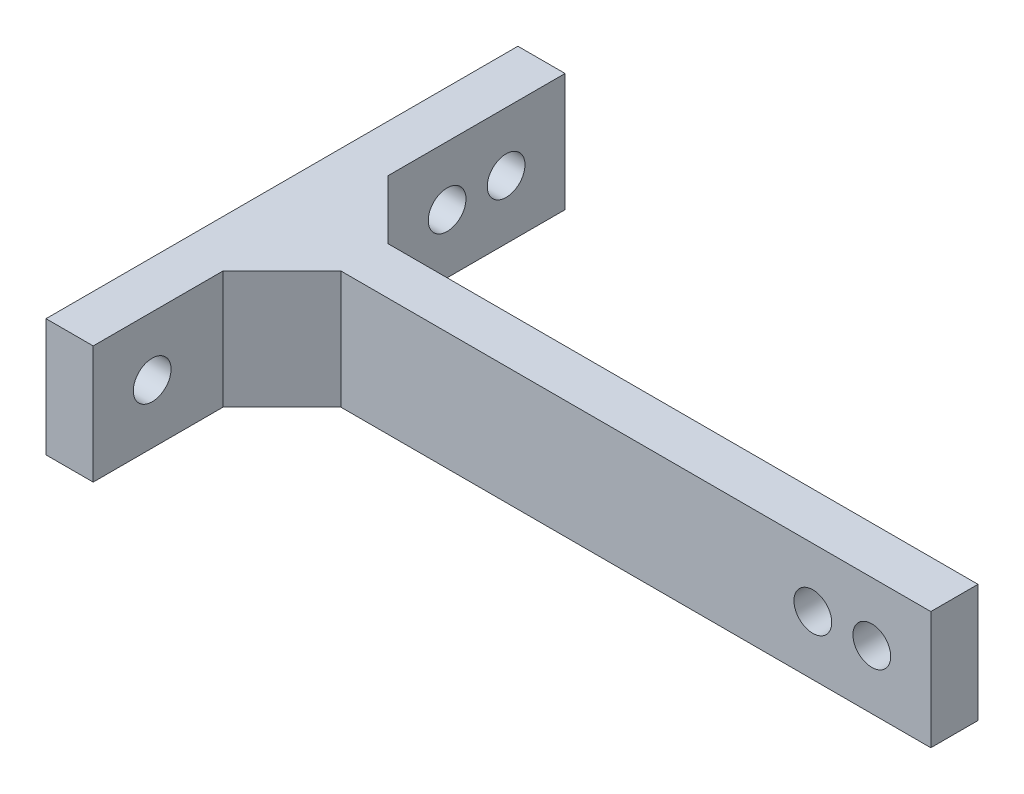
ISO-10303-21;
HEADER;
FILE_DESCRIPTION(('STEP AP214'),'2;1');
FILE_NAME('part.step','',(''),(''),'','','');
FILE_SCHEMA(('AUTOMOTIVE_DESIGN { 1 0 10303 214 1 1 1 1 }'));
ENDSEC;
DATA;
#1=APPLICATION_CONTEXT('core data for automotive mechanical design processes');
#2=APPLICATION_PROTOCOL_DEFINITION('international standard','automotive_design',2000,#1);
#3=PRODUCT_CONTEXT('',#1,'mechanical');
#4=PRODUCT('Part','Part','',(#3));
#5=PRODUCT_RELATED_PRODUCT_CATEGORY('part','',(#4));
#6=PRODUCT_DEFINITION_FORMATION('','',#4);
#7=PRODUCT_DEFINITION_CONTEXT('part definition',#1,'design');
#8=PRODUCT_DEFINITION('design','',#6,#7);
#9=PRODUCT_DEFINITION_SHAPE('','',#8);
#10=(LENGTH_UNIT() NAMED_UNIT(*) SI_UNIT(.MILLI.,.METRE.));
#11=(NAMED_UNIT(*) PLANE_ANGLE_UNIT() SI_UNIT($,.RADIAN.));
#12=(NAMED_UNIT(*) SI_UNIT($,.STERADIAN.) SOLID_ANGLE_UNIT());
#13=UNCERTAINTY_MEASURE_WITH_UNIT(LENGTH_MEASURE(1.E-05),#10,'distance_accuracy_value','');
#14=(GEOMETRIC_REPRESENTATION_CONTEXT(3) GLOBAL_UNCERTAINTY_ASSIGNED_CONTEXT((#13)) GLOBAL_UNIT_ASSIGNED_CONTEXT((#10,
#11,#12)) REPRESENTATION_CONTEXT('',''));
#15=CARTESIAN_POINT('',(0.,0.,0.));
#16=DIRECTION('',(0.,0.,1.));
#17=DIRECTION('',(1.,0.,0.));
#18=AXIS2_PLACEMENT_3D('',#15,#16,#17);
#19=CARTESIAN_POINT('',(0.,0.,4.));
#20=DIRECTION('',(0.,0.,1.));
#21=DIRECTION('',(1.,0.,0.));
#22=AXIS2_PLACEMENT_3D('',#19,#20,#21);
#23=PLANE('',#22);
#24=CARTESIAN_POINT('',(26.9796861870087,-2.54060324825986,4.));
#25=DIRECTION('',(0.,0.,1.));
#26=DIRECTION('',(1.,0.,0.));
#27=AXIS2_PLACEMENT_3D('',#24,#25,#26);
#28=CIRCLE('',#27,1.6);
#29=CARTESIAN_POINT('',(28.5796861870087,-2.54060324825986,4.));
#30=VERTEX_POINT('',#29);
#31=EDGE_CURVE('E147',#30,#30,#28,.T.);
#32=ORIENTED_EDGE('',*,*,#31,.F.);
#33=EDGE_LOOP('',(#32));
#34=FACE_BOUND('',#33,.T.);
#35=CARTESIAN_POINT('',(21.9796861870087,-2.54060324825989,4.));
#36=DIRECTION('',(0.,0.,1.));
#37=DIRECTION('',(1.,0.,0.));
#38=AXIS2_PLACEMENT_3D('',#35,#36,#37);
#39=CIRCLE('',#38,1.6);
#40=CARTESIAN_POINT('',(23.5796861870087,-2.54060324825989,4.));
#41=VERTEX_POINT('',#40);
#42=EDGE_CURVE('E152',#41,#41,#39,.T.);
#43=ORIENTED_EDGE('',*,*,#42,.F.);
#44=EDGE_LOOP('',(#43));
#45=FACE_BOUND('',#44,.T.);
#46=DIRECTION('',(-1.,0.,0.));
#47=VECTOR('',#46,1.);
#48=CARTESIAN_POINT('',(-23.0203138129913,2.45939675174014,4.));
#49=LINE('',#48,#47);
#50=CARTESIAN_POINT('',(31.9796861870087,2.45939675174014,4.));
#51=VERTEX_POINT('',#50);
#52=CARTESIAN_POINT('',(-18.0203138129913,2.45939675174014,4.));
#53=VERTEX_POINT('',#52);
#54=EDGE_CURVE('E118',#51,#53,#49,.T.);
#55=ORIENTED_EDGE('',*,*,#54,.T.);
#56=DIRECTION('',(0.,-1.,0.));
#57=VECTOR('',#56,1.);
#58=CARTESIAN_POINT('',(-18.0203138129913,2.45939675174014,4.));
#59=LINE('',#58,#57);
#60=CARTESIAN_POINT('',(-18.0203138129913,-7.54060324825986,4.));
#61=VERTEX_POINT('',#60);
#62=EDGE_CURVE('E123',#53,#61,#59,.T.);
#63=ORIENTED_EDGE('',*,*,#62,.T.);
#64=DIRECTION('',(1.,0.,0.));
#65=VECTOR('',#64,1.);
#66=CARTESIAN_POINT('',(-23.0203138129913,-7.54060324825986,4.));
#67=LINE('',#66,#65);
#68=CARTESIAN_POINT('',(31.9796861870087,-7.54060324825986,4.));
#69=VERTEX_POINT('',#68);
#70=EDGE_CURVE('E135',#61,#69,#67,.T.);
#71=ORIENTED_EDGE('',*,*,#70,.T.);
#72=DIRECTION('',(0.,1.,0.));
#73=VECTOR('',#72,1.);
#74=CARTESIAN_POINT('',(31.9796861870087,2.45939675174014,4.));
#75=LINE('',#74,#73);
#76=EDGE_CURVE('E131',#69,#51,#75,.T.);
#77=ORIENTED_EDGE('',*,*,#76,.T.);
#78=EDGE_LOOP('',(#55,#63,#71,#77));
#79=FACE_BOUND('',#78,.T.);
#80=ADVANCED_FACE('F34',(#34,#45,#79),#23,.T.);
#81=CARTESIAN_POINT('',(-23.0203138129913,0.,0.));
#82=DIRECTION('',(-1.,0.,0.));
#83=DIRECTION('',(0.,0.,1.));
#84=AXIS2_PLACEMENT_3D('',#81,#82,#83);
#85=PLANE('',#84);
#86=CARTESIAN_POINT('',(-23.0203138129913,-2.54060324825986,15.));
#87=DIRECTION('',(1.,0.,0.));
#88=DIRECTION('',(0.,0.,-1.));
#89=AXIS2_PLACEMENT_3D('',#86,#87,#88);
#90=CIRCLE('',#89,1.6);
#91=CARTESIAN_POINT('',(-23.0203138129913,-2.54060324825986,13.4));
#92=VERTEX_POINT('',#91);
#93=EDGE_CURVE('E270',#92,#92,#90,.T.);
#94=ORIENTED_EDGE('',*,*,#93,.F.);
#95=EDGE_LOOP('',(#94));
#96=FACE_BOUND('',#95,.T.);
#97=DIRECTION('',(0.,-1.,0.));
#98=VECTOR('',#97,1.);
#99=CARTESIAN_POINT('',(-23.0203138129913,2.45939675174014,9.));
#100=LINE('',#99,#98);
#101=CARTESIAN_POINT('',(-23.0203138129913,2.45939675174014,9.));
#102=VERTEX_POINT('',#101);
#103=CARTESIAN_POINT('',(-23.0203138129913,-7.54060324825986,9.));
#104=VERTEX_POINT('',#103);
#105=EDGE_CURVE('E128',#102,#104,#100,.T.);
#106=ORIENTED_EDGE('',*,*,#105,.F.);
#107=DIRECTION('',(0.,0.,1.));
#108=VECTOR('',#107,1.);
#109=CARTESIAN_POINT('',(-23.0203138129913,2.45939675174014,-20.));
#110=LINE('',#109,#108);
#111=CARTESIAN_POINT('',(-23.0203138129913,2.45939675174014,20.));
#112=VERTEX_POINT('',#111);
#113=EDGE_CURVE('E120',#102,#112,#110,.T.);
#114=ORIENTED_EDGE('',*,*,#113,.T.);
#115=DIRECTION('',(0.,-1.,0.));
#116=VECTOR('',#115,1.);
#117=CARTESIAN_POINT('',(-23.0203138129913,2.45939675174014,20.));
#118=LINE('',#117,#116);
#119=CARTESIAN_POINT('',(-23.0203138129913,-7.54060324825986,20.));
#120=VERTEX_POINT('',#119);
#121=EDGE_CURVE('E195',#112,#120,#118,.T.);
#122=ORIENTED_EDGE('',*,*,#121,.T.);
#123=DIRECTION('',(0.,0.,1.));
#124=VECTOR('',#123,1.);
#125=CARTESIAN_POINT('',(-23.0203138129913,-7.54060324825986,-20.));
#126=LINE('',#125,#124);
#127=EDGE_CURVE('E191',#104,#120,#126,.T.);
#128=ORIENTED_EDGE('',*,*,#127,.F.);
#129=EDGE_LOOP('',(#106,#114,#122,#128));
#130=FACE_BOUND('',#129,.T.);
#131=ADVANCED_FACE('F234',(#96,#130),#85,.F.);
#132=CARTESIAN_POINT('',(0.,0.,0.));
#133=DIRECTION('',(0.,0.,1.));
#134=DIRECTION('',(1.,0.,0.));
#135=AXIS2_PLACEMENT_3D('',#132,#133,#134);
#136=PLANE('',#135);
#137=CARTESIAN_POINT('',(26.9796861870087,-2.54060324825986,0.));
#138=DIRECTION('',(0.,0.,1.));
#139=DIRECTION('',(1.,0.,0.));
#140=AXIS2_PLACEMENT_3D('',#137,#138,#139);
#141=CIRCLE('',#140,1.6);
#142=CARTESIAN_POINT('',(28.5796861870087,-2.54060324825986,0.));
#143=VERTEX_POINT('',#142);
#144=EDGE_CURVE('E38',#143,#143,#141,.T.);
#145=ORIENTED_EDGE('',*,*,#144,.T.);
#146=EDGE_LOOP('',(#145));
#147=FACE_BOUND('',#146,.T.);
#148=CARTESIAN_POINT('',(21.9796861870087,-2.54060324825989,0.));
#149=DIRECTION('',(0.,0.,1.));
#150=DIRECTION('',(1.,0.,0.));
#151=AXIS2_PLACEMENT_3D('',#148,#149,#150);
#152=CIRCLE('',#151,1.6);
#153=CARTESIAN_POINT('',(23.5796861870087,-2.54060324825989,0.));
#154=VERTEX_POINT('',#153);
#155=EDGE_CURVE('E145',#154,#154,#152,.T.);
#156=ORIENTED_EDGE('',*,*,#155,.T.);
#157=EDGE_LOOP('',(#156));
#158=FACE_BOUND('',#157,.T.);
#159=DIRECTION('',(0.,1.,0.));
#160=VECTOR('',#159,1.);
#161=CARTESIAN_POINT('',(-18.0203138129913,-7.54060324825986,0.));
#162=LINE('',#161,#160);
#163=CARTESIAN_POINT('',(-18.0203138129913,-7.54060324825986,0.));
#164=VERTEX_POINT('',#163);
#165=CARTESIAN_POINT('',(-18.0203138129913,2.45939675174014,0.));
#166=VERTEX_POINT('',#165);
#167=EDGE_CURVE('E168',#164,#166,#162,.T.);
#168=ORIENTED_EDGE('',*,*,#167,.T.);
#169=DIRECTION('',(-1.,0.,0.));
#170=VECTOR('',#169,1.);
#171=CARTESIAN_POINT('',(-23.0203138129913,2.45939675174014,0.));
#172=LINE('',#171,#170);
#173=CARTESIAN_POINT('',(31.9796861870087,2.45939675174014,0.));
#174=VERTEX_POINT('',#173);
#175=EDGE_CURVE('E143',#174,#166,#172,.T.);
#176=ORIENTED_EDGE('',*,*,#175,.F.);
#177=DIRECTION('',(0.,1.,0.));
#178=VECTOR('',#177,1.);
#179=CARTESIAN_POINT('',(31.9796861870087,2.45939675174014,0.));
#180=LINE('',#179,#178);
#181=CARTESIAN_POINT('',(31.9796861870087,-7.54060324825986,0.));
#182=VERTEX_POINT('',#181);
#183=EDGE_CURVE('E140',#182,#174,#180,.T.);
#184=ORIENTED_EDGE('',*,*,#183,.F.);
#185=DIRECTION('',(1.,0.,0.));
#186=VECTOR('',#185,1.);
#187=CARTESIAN_POINT('',(-23.0203138129913,-7.54060324825986,0.));
#188=LINE('',#187,#186);
#189=EDGE_CURVE('E59',#164,#182,#188,.T.);
#190=ORIENTED_EDGE('',*,*,#189,.F.);
#191=EDGE_LOOP('',(#168,#176,#184,#190));
#192=FACE_BOUND('',#191,.T.);
#193=ADVANCED_FACE('F211',(#147,#158,#192),#136,.F.);
#194=CARTESIAN_POINT('',(-23.0203138129913,-2.54060324825986,-10.));
#195=DIRECTION('',(1.,0.,0.));
#196=DIRECTION('',(0.,0.,-1.));
#197=AXIS2_PLACEMENT_3D('',#194,#195,#196);
#198=CIRCLE('',#197,1.6);
#199=CARTESIAN_POINT('',(-23.0203138129913,-2.54060324825986,-11.6));
#200=VERTEX_POINT('',#199);
#201=EDGE_CURVE('E257',#200,#200,#198,.T.);
#202=ORIENTED_EDGE('',*,*,#201,.F.);
#203=EDGE_LOOP('',(#202));
#204=FACE_BOUND('',#203,.T.);
#205=CARTESIAN_POINT('',(-23.0203138129913,-2.54060324825986,-15.));
#206=DIRECTION('',(1.,0.,0.));
#207=DIRECTION('',(0.,0.,-1.));
#208=AXIS2_PLACEMENT_3D('',#205,#206,#207);
#209=CIRCLE('',#208,1.6);
#210=CARTESIAN_POINT('',(-23.0203138129913,-2.54060324825986,-16.6));
#211=VERTEX_POINT('',#210);
#212=EDGE_CURVE('E160',#211,#211,#209,.T.);
#213=ORIENTED_EDGE('',*,*,#212,.F.);
#214=EDGE_LOOP('',(#213));
#215=FACE_BOUND('',#214,.T.);
#216=DIRECTION('',(0.,1.,0.));
#217=VECTOR('',#216,1.);
#218=CARTESIAN_POINT('',(-23.0203138129913,-7.54060324825986,-5.));
#219=LINE('',#218,#217);
#220=CARTESIAN_POINT('',(-23.0203138129913,-7.54060324825986,-5.));
#221=VERTEX_POINT('',#220);
#222=CARTESIAN_POINT('',(-23.0203138129913,2.45939675174014,-5.));
#223=VERTEX_POINT('',#222);
#224=EDGE_CURVE('E172',#221,#223,#219,.T.);
#225=ORIENTED_EDGE('',*,*,#224,.F.);
#226=CARTESIAN_POINT('',(-23.0203138129913,-7.54060324825986,-20.));
#227=VERTEX_POINT('',#226);
#228=EDGE_CURVE('E192',#227,#221,#126,.T.);
#229=ORIENTED_EDGE('',*,*,#228,.F.);
#230=DIRECTION('',(0.,-1.,0.));
#231=VECTOR('',#230,1.);
#232=CARTESIAN_POINT('',(-23.0203138129913,2.45939675174014,-20.));
#233=LINE('',#232,#231);
#234=CARTESIAN_POINT('',(-23.0203138129913,2.45939675174014,-20.));
#235=VERTEX_POINT('',#234);
#236=EDGE_CURVE('E175',#235,#227,#233,.T.);
#237=ORIENTED_EDGE('',*,*,#236,.F.);
#238=EDGE_CURVE('E180',#235,#223,#110,.T.);
#239=ORIENTED_EDGE('',*,*,#238,.T.);
#240=EDGE_LOOP('',(#225,#229,#237,#239));
#241=FACE_BOUND('',#240,.T.);
#242=ADVANCED_FACE('F220',(#204,#215,#241),#85,.F.);
#243=CARTESIAN_POINT('',(-23.0203138129913,-7.54060324825986,4.));
#244=DIRECTION('',(0.,1.,0.));
#245=DIRECTION('',(0.,0.,1.));
#246=AXIS2_PLACEMENT_3D('',#243,#244,#245);
#247=PLANE('',#246);
#248=ORIENTED_EDGE('',*,*,#70,.F.);
#249=DIRECTION('',(0.707106781186548,0.,-0.707106781186548));
#250=VECTOR('',#249,1.);
#251=CARTESIAN_POINT('',(-23.0203138129913,-7.54060324825986,9.));
#252=LINE('',#251,#250);
#253=EDGE_CURVE('E51',#104,#61,#252,.T.);
#254=ORIENTED_EDGE('',*,*,#253,.F.);
#255=ORIENTED_EDGE('',*,*,#127,.T.);
#256=DIRECTION('',(1.,0.,0.));
#257=VECTOR('',#256,1.);
#258=CARTESIAN_POINT('',(-27.0203138129913,-7.54060324825986,20.));
#259=LINE('',#258,#257);
#260=CARTESIAN_POINT('',(-27.0203138129913,-7.54060324825986,20.));
#261=VERTEX_POINT('',#260);
#262=EDGE_CURVE('E202',#261,#120,#259,.T.);
#263=ORIENTED_EDGE('',*,*,#262,.F.);
#264=DIRECTION('',(0.,0.,1.));
#265=VECTOR('',#264,1.);
#266=CARTESIAN_POINT('',(-27.0203138129913,-7.54060324825986,-20.));
#267=LINE('',#266,#265);
#268=CARTESIAN_POINT('',(-27.0203138129913,-7.54060324825986,-20.));
#269=VERTEX_POINT('',#268);
#270=EDGE_CURVE('E179',#269,#261,#267,.T.);
#271=ORIENTED_EDGE('',*,*,#270,.F.);
#272=DIRECTION('',(1.,0.,0.));
#273=VECTOR('',#272,1.);
#274=CARTESIAN_POINT('',(-27.0203138129913,-7.54060324825986,-20.));
#275=LINE('',#274,#273);
#276=EDGE_CURVE('E141',#269,#227,#275,.T.);
#277=ORIENTED_EDGE('',*,*,#276,.T.);
#278=ORIENTED_EDGE('',*,*,#228,.T.);
#279=DIRECTION('',(0.707106781186548,0.,0.707106781186547));
#280=VECTOR('',#279,1.);
#281=CARTESIAN_POINT('',(-23.0203138129913,-7.54060324825986,-5.));
#282=LINE('',#281,#280);
#283=EDGE_CURVE('E166',#221,#164,#282,.T.);
#284=ORIENTED_EDGE('',*,*,#283,.T.);
#285=ORIENTED_EDGE('',*,*,#189,.T.);
#286=DIRECTION('',(0.,0.,-1.));
#287=VECTOR('',#286,1.);
#288=CARTESIAN_POINT('',(31.9796861870087,-7.54060324825986,4.));
#289=LINE('',#288,#287);
#290=EDGE_CURVE('E11',#69,#182,#289,.T.);
#291=ORIENTED_EDGE('',*,*,#290,.F.);
#292=EDGE_LOOP('',(#248,#254,#255,#263,#271,#277,#278,#284,#285,#291));
#293=FACE_BOUND('',#292,.T.);
#294=ADVANCED_FACE('F36',(#293),#247,.F.);
#295=CARTESIAN_POINT('',(31.9796861870087,2.45939675174014,4.));
#296=DIRECTION('',(-1.,0.,0.));
#297=DIRECTION('',(0.,-1.,0.));
#298=AXIS2_PLACEMENT_3D('',#295,#296,#297);
#299=PLANE('',#298);
#300=ORIENTED_EDGE('',*,*,#183,.T.);
#301=DIRECTION('',(0.,0.,-1.));
#302=VECTOR('',#301,1.);
#303=CARTESIAN_POINT('',(31.9796861870087,2.45939675174014,4.));
#304=LINE('',#303,#302);
#305=EDGE_CURVE('E43',#51,#174,#304,.T.);
#306=ORIENTED_EDGE('',*,*,#305,.F.);
#307=ORIENTED_EDGE('',*,*,#76,.F.);
#308=ORIENTED_EDGE('',*,*,#290,.T.);
#309=EDGE_LOOP('',(#300,#306,#307,#308));
#310=FACE_BOUND('',#309,.T.);
#311=ADVANCED_FACE('F208',(#310),#299,.F.);
#312=CARTESIAN_POINT('',(-23.0203138129913,2.45939675174014,4.));
#313=DIRECTION('',(0.,-1.,0.));
#314=DIRECTION('',(1.,0.,0.));
#315=AXIS2_PLACEMENT_3D('',#312,#313,#314);
#316=PLANE('',#315);
#317=DIRECTION('',(0.707106781186548,0.,-0.707106781186548));
#318=VECTOR('',#317,1.);
#319=CARTESIAN_POINT('',(-23.0203138129913,2.45939675174014,9.));
#320=LINE('',#319,#318);
#321=EDGE_CURVE('E113',#102,#53,#320,.T.);
#322=ORIENTED_EDGE('',*,*,#321,.T.);
#323=ORIENTED_EDGE('',*,*,#54,.F.);
#324=ORIENTED_EDGE('',*,*,#305,.T.);
#325=ORIENTED_EDGE('',*,*,#175,.T.);
#326=DIRECTION('',(0.707106781186548,0.,0.707106781186547));
#327=VECTOR('',#326,1.);
#328=CARTESIAN_POINT('',(-23.0203138129913,2.45939675174014,-5.));
#329=LINE('',#328,#327);
#330=EDGE_CURVE('E164',#223,#166,#329,.T.);
#331=ORIENTED_EDGE('',*,*,#330,.F.);
#332=ORIENTED_EDGE('',*,*,#238,.F.);
#333=DIRECTION('',(1.,0.,0.));
#334=VECTOR('',#333,1.);
#335=CARTESIAN_POINT('',(-27.0203138129913,2.45939675174014,-20.));
#336=LINE('',#335,#334);
#337=CARTESIAN_POINT('',(-27.0203138129913,2.45939675174014,-20.));
#338=VERTEX_POINT('',#337);
#339=EDGE_CURVE('E188',#338,#235,#336,.T.);
#340=ORIENTED_EDGE('',*,*,#339,.F.);
#341=DIRECTION('',(0.,0.,1.));
#342=VECTOR('',#341,1.);
#343=CARTESIAN_POINT('',(-27.0203138129913,2.45939675174014,-20.));
#344=LINE('',#343,#342);
#345=CARTESIAN_POINT('',(-27.0203138129913,2.45939675174014,20.));
#346=VERTEX_POINT('',#345);
#347=EDGE_CURVE('E185',#338,#346,#344,.T.);
#348=ORIENTED_EDGE('',*,*,#347,.T.);
#349=DIRECTION('',(1.,0.,0.));
#350=VECTOR('',#349,1.);
#351=CARTESIAN_POINT('',(-27.0203138129913,2.45939675174014,20.));
#352=LINE('',#351,#350);
#353=EDGE_CURVE('E200',#346,#112,#352,.T.);
#354=ORIENTED_EDGE('',*,*,#353,.T.);
#355=ORIENTED_EDGE('',*,*,#113,.F.);
#356=EDGE_LOOP('',(#322,#323,#324,#325,#331,#332,#340,#348,#354,#355));
#357=FACE_BOUND('',#356,.T.);
#358=ADVANCED_FACE('F115',(#357),#316,.F.);
#359=CARTESIAN_POINT('',(-27.0203138129913,2.45939675174014,-20.));
#360=DIRECTION('',(0.,0.,1.));
#361=DIRECTION('',(0.,-1.,0.));
#362=AXIS2_PLACEMENT_3D('',#359,#360,#361);
#363=PLANE('',#362);
#364=ORIENTED_EDGE('',*,*,#236,.T.);
#365=ORIENTED_EDGE('',*,*,#276,.F.);
#366=DIRECTION('',(0.,-1.,0.));
#367=VECTOR('',#366,1.);
#368=CARTESIAN_POINT('',(-27.0203138129913,2.45939675174014,-20.));
#369=LINE('',#368,#367);
#370=EDGE_CURVE('E176',#338,#269,#369,.T.);
#371=ORIENTED_EDGE('',*,*,#370,.F.);
#372=ORIENTED_EDGE('',*,*,#339,.T.);
#373=EDGE_LOOP('',(#364,#365,#371,#372));
#374=FACE_BOUND('',#373,.T.);
#375=ADVANCED_FACE('F223',(#374),#363,.F.);
#376=CARTESIAN_POINT('',(-27.0203138129913,2.45939675174014,20.));
#377=DIRECTION('',(0.,0.,1.));
#378=DIRECTION('',(1.,0.,0.));
#379=AXIS2_PLACEMENT_3D('',#376,#377,#378);
#380=PLANE('',#379);
#381=ORIENTED_EDGE('',*,*,#121,.F.);
#382=ORIENTED_EDGE('',*,*,#353,.F.);
#383=DIRECTION('',(0.,-1.,0.));
#384=VECTOR('',#383,1.);
#385=CARTESIAN_POINT('',(-27.0203138129913,2.45939675174014,20.));
#386=LINE('',#385,#384);
#387=EDGE_CURVE('E182',#346,#261,#386,.T.);
#388=ORIENTED_EDGE('',*,*,#387,.T.);
#389=ORIENTED_EDGE('',*,*,#262,.T.);
#390=EDGE_LOOP('',(#381,#382,#388,#389));
#391=FACE_BOUND('',#390,.T.);
#392=ADVANCED_FACE('F230',(#391),#380,.T.);
#393=CARTESIAN_POINT('',(-27.0203138129913,0.,0.));
#394=DIRECTION('',(-1.,0.,0.));
#395=DIRECTION('',(0.,0.,1.));
#396=AXIS2_PLACEMENT_3D('',#393,#394,#395);
#397=PLANE('',#396);
#398=CARTESIAN_POINT('',(-27.0203138129913,-2.54060324825986,15.));
#399=DIRECTION('',(1.,0.,0.));
#400=DIRECTION('',(0.,0.,-1.));
#401=AXIS2_PLACEMENT_3D('',#398,#399,#400);
#402=CIRCLE('',#401,1.6);
#403=CARTESIAN_POINT('',(-27.0203138129913,-2.54060324825986,13.4));
#404=VERTEX_POINT('',#403);
#405=EDGE_CURVE('E157',#404,#404,#402,.T.);
#406=ORIENTED_EDGE('',*,*,#405,.T.);
#407=EDGE_LOOP('',(#406));
#408=FACE_BOUND('',#407,.T.);
#409=CARTESIAN_POINT('',(-27.0203138129913,-2.54060324825986,-10.));
#410=DIRECTION('',(1.,0.,0.));
#411=DIRECTION('',(0.,0.,-1.));
#412=AXIS2_PLACEMENT_3D('',#409,#410,#411);
#413=CIRCLE('',#412,1.6);
#414=CARTESIAN_POINT('',(-27.0203138129913,-2.54060324825986,-11.6));
#415=VERTEX_POINT('',#414);
#416=EDGE_CURVE('E265',#415,#415,#413,.T.);
#417=ORIENTED_EDGE('',*,*,#416,.T.);
#418=EDGE_LOOP('',(#417));
#419=FACE_BOUND('',#418,.T.);
#420=CARTESIAN_POINT('',(-27.0203138129913,-2.54060324825986,-15.));
#421=DIRECTION('',(1.,0.,0.));
#422=DIRECTION('',(0.,0.,-1.));
#423=AXIS2_PLACEMENT_3D('',#420,#421,#422);
#424=CIRCLE('',#423,1.6);
#425=CARTESIAN_POINT('',(-27.0203138129913,-2.54060324825986,-16.6));
#426=VERTEX_POINT('',#425);
#427=EDGE_CURVE('E261',#426,#426,#424,.T.);
#428=ORIENTED_EDGE('',*,*,#427,.T.);
#429=EDGE_LOOP('',(#428));
#430=FACE_BOUND('',#429,.T.);
#431=ORIENTED_EDGE('',*,*,#370,.T.);
#432=ORIENTED_EDGE('',*,*,#270,.T.);
#433=ORIENTED_EDGE('',*,*,#387,.F.);
#434=ORIENTED_EDGE('',*,*,#347,.F.);
#435=EDGE_LOOP('',(#431,#432,#433,#434));
#436=FACE_BOUND('',#435,.T.);
#437=ADVANCED_FACE('F227',(#408,#419,#430,#436),#397,.T.);
#438=CARTESIAN_POINT('',(-23.0203138129913,-7.54060324825986,-5.));
#439=DIRECTION('',(-0.707106781186547,0.,0.707106781186548));
#440=DIRECTION('',(0.707106781186548,0.,0.707106781186547));
#441=AXIS2_PLACEMENT_3D('',#438,#439,#440);
#442=PLANE('',#441);
#443=ORIENTED_EDGE('',*,*,#330,.T.);
#444=ORIENTED_EDGE('',*,*,#167,.F.);
#445=ORIENTED_EDGE('',*,*,#283,.F.);
#446=ORIENTED_EDGE('',*,*,#224,.T.);
#447=EDGE_LOOP('',(#443,#444,#445,#446));
#448=FACE_BOUND('',#447,.T.);
#449=ADVANCED_FACE('F215',(#448),#442,.F.);
#450=CARTESIAN_POINT('',(-23.0203138129913,2.45939675174014,9.));
#451=DIRECTION('',(-0.707106781186548,0.,-0.707106781186548));
#452=DIRECTION('',(-0.707106781186548,0.,0.707106781186548));
#453=AXIS2_PLACEMENT_3D('',#450,#451,#452);
#454=PLANE('',#453);
#455=ORIENTED_EDGE('',*,*,#253,.T.);
#456=ORIENTED_EDGE('',*,*,#62,.F.);
#457=ORIENTED_EDGE('',*,*,#321,.F.);
#458=ORIENTED_EDGE('',*,*,#105,.T.);
#459=EDGE_LOOP('',(#455,#456,#457,#458));
#460=FACE_BOUND('',#459,.T.);
#461=ADVANCED_FACE('F126',(#460),#454,.F.);
#462=CARTESIAN_POINT('',(21.9796861870087,-2.54060324825989,-1.));
#463=DIRECTION('',(0.,0.,1.));
#464=DIRECTION('',(1.,0.,0.));
#465=AXIS2_PLACEMENT_3D('',#462,#463,#464);
#466=CYLINDRICAL_SURFACE('',#465,1.6);
#467=ORIENTED_EDGE('',*,*,#42,.T.);
#468=EDGE_LOOP('',(#467));
#469=FACE_BOUND('',#468,.T.);
#470=ORIENTED_EDGE('',*,*,#155,.F.);
#471=EDGE_LOOP('',(#470));
#472=FACE_BOUND('',#471,.T.);
#473=ADVANCED_FACE('F296',(#469,#472),#466,.F.);
#474=CARTESIAN_POINT('',(26.9796861870087,-2.54060324825986,-1.));
#475=DIRECTION('',(0.,0.,1.));
#476=DIRECTION('',(1.,0.,0.));
#477=AXIS2_PLACEMENT_3D('',#474,#475,#476);
#478=CYLINDRICAL_SURFACE('',#477,1.6);
#479=ORIENTED_EDGE('',*,*,#31,.T.);
#480=EDGE_LOOP('',(#479));
#481=FACE_BOUND('',#480,.T.);
#482=ORIENTED_EDGE('',*,*,#144,.F.);
#483=EDGE_LOOP('',(#482));
#484=FACE_BOUND('',#483,.T.);
#485=ADVANCED_FACE('F292',(#481,#484),#478,.F.);
#486=CARTESIAN_POINT('',(-27.0203138129913,-2.54060324825986,-15.));
#487=DIRECTION('',(1.,0.,0.));
#488=DIRECTION('',(0.,0.,-1.));
#489=AXIS2_PLACEMENT_3D('',#486,#487,#488);
#490=CYLINDRICAL_SURFACE('',#489,1.6);
#491=ORIENTED_EDGE('',*,*,#427,.F.);
#492=EDGE_LOOP('',(#491));
#493=FACE_BOUND('',#492,.T.);
#494=ORIENTED_EDGE('',*,*,#212,.T.);
#495=EDGE_LOOP('',(#494));
#496=FACE_BOUND('',#495,.T.);
#497=ADVANCED_FACE('F286',(#493,#496),#490,.F.);
#498=CARTESIAN_POINT('',(-27.0203138129913,-2.54060324825986,-10.));
#499=DIRECTION('',(1.,0.,0.));
#500=DIRECTION('',(0.,0.,-1.));
#501=AXIS2_PLACEMENT_3D('',#498,#499,#500);
#502=CYLINDRICAL_SURFACE('',#501,1.6);
#503=ORIENTED_EDGE('',*,*,#416,.F.);
#504=EDGE_LOOP('',(#503));
#505=FACE_BOUND('',#504,.T.);
#506=ORIENTED_EDGE('',*,*,#201,.T.);
#507=EDGE_LOOP('',(#506));
#508=FACE_BOUND('',#507,.T.);
#509=ADVANCED_FACE('F281',(#505,#508),#502,.F.);
#510=CARTESIAN_POINT('',(-27.0203138129913,-2.54060324825986,15.));
#511=DIRECTION('',(1.,0.,0.));
#512=DIRECTION('',(0.,0.,-1.));
#513=AXIS2_PLACEMENT_3D('',#510,#511,#512);
#514=CYLINDRICAL_SURFACE('',#513,1.6);
#515=ORIENTED_EDGE('',*,*,#405,.F.);
#516=EDGE_LOOP('',(#515));
#517=FACE_BOUND('',#516,.T.);
#518=ORIENTED_EDGE('',*,*,#93,.T.);
#519=EDGE_LOOP('',(#518));
#520=FACE_BOUND('',#519,.T.);
#521=ADVANCED_FACE('F278',(#517,#520),#514,.F.);
#522=CLOSED_SHELL('',(#80,#131,#193,#242,#294,#311,#358,#375,#392,#437,#449,#461,#473,#485,#497,
#509,#521));
#523=MANIFOLD_SOLID_BREP('B2',#522);
#524=ADVANCED_BREP_SHAPE_REPRESENTATION('',(#18,#523),#14);
#525=SHAPE_DEFINITION_REPRESENTATION(#9,#524);
ENDSEC;
END-ISO-10303-21;
